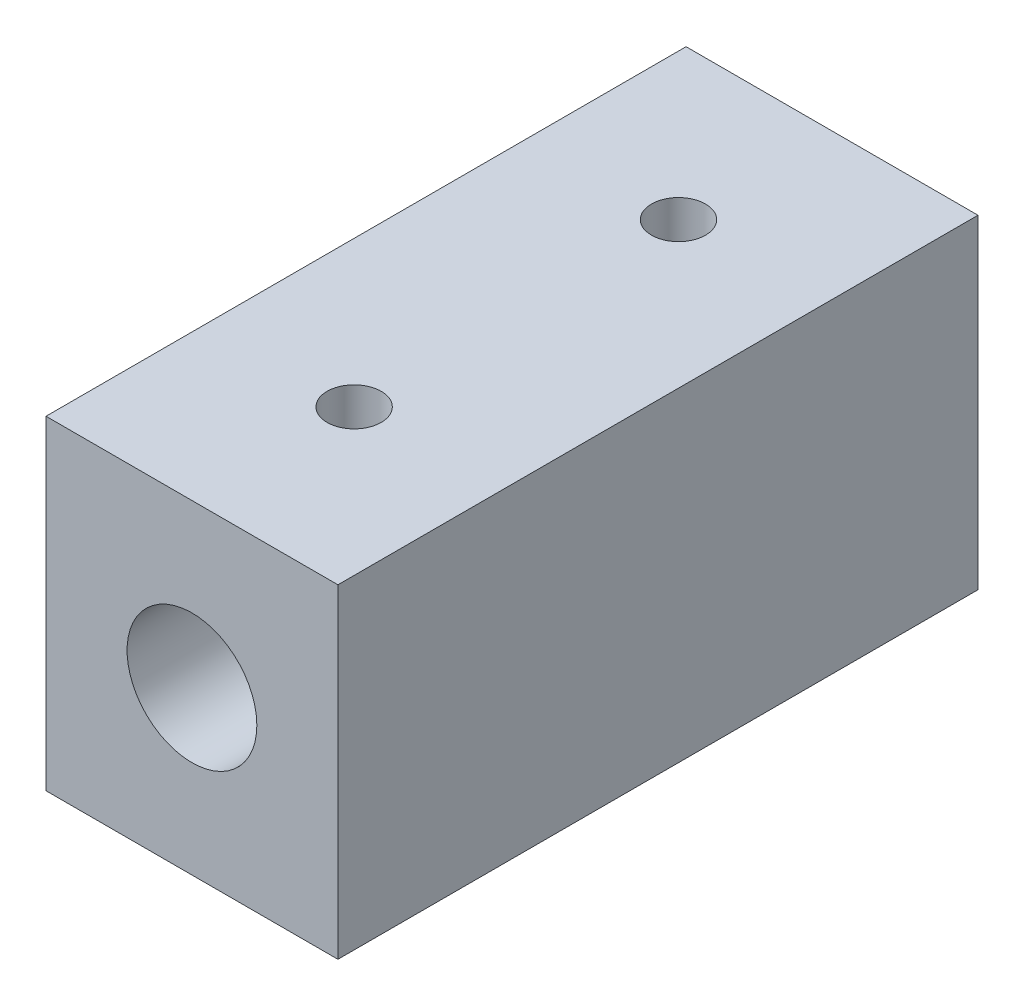
ISO-10303-21;
HEADER;
FILE_DESCRIPTION(('STEP AP214'),'2;1');
FILE_NAME('part.step','',(''),(''),'','','');
FILE_SCHEMA(('AUTOMOTIVE_DESIGN { 1 0 10303 214 1 1 1 1 }'));
ENDSEC;
DATA;
#1=APPLICATION_CONTEXT('core data for automotive mechanical design processes');
#2=APPLICATION_PROTOCOL_DEFINITION('international standard','automotive_design',2000,#1);
#3=PRODUCT_CONTEXT('',#1,'mechanical');
#4=PRODUCT('Part','Part','',(#3));
#5=PRODUCT_RELATED_PRODUCT_CATEGORY('part','',(#4));
#6=PRODUCT_DEFINITION_FORMATION('','',#4);
#7=PRODUCT_DEFINITION_CONTEXT('part definition',#1,'design');
#8=PRODUCT_DEFINITION('design','',#6,#7);
#9=PRODUCT_DEFINITION_SHAPE('','',#8);
#10=(LENGTH_UNIT() NAMED_UNIT(*) SI_UNIT(.MILLI.,.METRE.));
#11=(NAMED_UNIT(*) PLANE_ANGLE_UNIT() SI_UNIT($,.RADIAN.));
#12=(NAMED_UNIT(*) SI_UNIT($,.STERADIAN.) SOLID_ANGLE_UNIT());
#13=UNCERTAINTY_MEASURE_WITH_UNIT(LENGTH_MEASURE(1.E-05),#10,'distance_accuracy_value','');
#14=(GEOMETRIC_REPRESENTATION_CONTEXT(3) GLOBAL_UNCERTAINTY_ASSIGNED_CONTEXT((#13)) GLOBAL_UNIT_ASSIGNED_CONTEXT((#10,
#11,#12)) REPRESENTATION_CONTEXT('',''));
#15=CARTESIAN_POINT('',(0.,0.,0.));
#16=DIRECTION('',(0.,0.,1.));
#17=DIRECTION('',(1.,0.,0.));
#18=AXIS2_PLACEMENT_3D('',#15,#16,#17);
#19=CARTESIAN_POINT('',(-6.75,7.5,14.8));
#20=DIRECTION('',(1.,0.,0.));
#21=DIRECTION('',(0.,1.,0.));
#22=AXIS2_PLACEMENT_3D('',#19,#20,#21);
#23=PLANE('',#22);
#24=DIRECTION('',(0.,-1.,0.));
#25=VECTOR('',#24,1.);
#26=CARTESIAN_POINT('',(-6.75,7.5,-14.8));
#27=LINE('',#26,#25);
#28=CARTESIAN_POINT('',(-6.75,7.5,-14.8));
#29=VERTEX_POINT('',#28);
#30=CARTESIAN_POINT('',(-6.75,-7.5,-14.8));
#31=VERTEX_POINT('',#30);
#32=EDGE_CURVE('E132',#29,#31,#27,.T.);
#33=ORIENTED_EDGE('',*,*,#32,.T.);
#34=DIRECTION('',(0.,0.,-1.));
#35=VECTOR('',#34,1.);
#36=CARTESIAN_POINT('',(-6.75,-7.5,14.8));
#37=LINE('',#36,#35);
#38=CARTESIAN_POINT('',(-6.75,-7.5,14.8));
#39=VERTEX_POINT('',#38);
#40=EDGE_CURVE('E11',#39,#31,#37,.T.);
#41=ORIENTED_EDGE('',*,*,#40,.F.);
#42=DIRECTION('',(0.,-1.,0.));
#43=VECTOR('',#42,1.);
#44=CARTESIAN_POINT('',(-6.75,7.5,14.8));
#45=LINE('',#44,#43);
#46=CARTESIAN_POINT('',(-6.75,7.5,14.8));
#47=VERTEX_POINT('',#46);
#48=EDGE_CURVE('E137',#47,#39,#45,.T.);
#49=ORIENTED_EDGE('',*,*,#48,.F.);
#50=DIRECTION('',(0.,0.,-1.));
#51=VECTOR('',#50,1.);
#52=CARTESIAN_POINT('',(-6.75,7.5,14.8));
#53=LINE('',#52,#51);
#54=EDGE_CURVE('E147',#47,#29,#53,.T.);
#55=ORIENTED_EDGE('',*,*,#54,.T.);
#56=EDGE_LOOP('',(#33,#41,#49,#55));
#57=FACE_BOUND('',#56,.T.);
#58=ADVANCED_FACE('F43',(#57),#23,.F.);
#59=CARTESIAN_POINT('',(-6.75,-7.5,14.8));
#60=DIRECTION('',(0.,1.,0.));
#61=DIRECTION('',(0.,0.,1.));
#62=AXIS2_PLACEMENT_3D('',#59,#60,#61);
#63=PLANE('',#62);
#64=DIRECTION('',(1.,0.,0.));
#65=VECTOR('',#64,1.);
#66=CARTESIAN_POINT('',(-6.75,-7.5,-14.8));
#67=LINE('',#66,#65);
#68=CARTESIAN_POINT('',(6.75,-7.5,-14.8));
#69=VERTEX_POINT('',#68);
#70=EDGE_CURVE('E151',#31,#69,#67,.T.);
#71=ORIENTED_EDGE('',*,*,#70,.T.);
#72=DIRECTION('',(0.,0.,-1.));
#73=VECTOR('',#72,1.);
#74=CARTESIAN_POINT('',(6.75,-7.5,14.8));
#75=LINE('',#74,#73);
#76=CARTESIAN_POINT('',(6.75,-7.5,14.8));
#77=VERTEX_POINT('',#76);
#78=EDGE_CURVE('E53',#77,#69,#75,.T.);
#79=ORIENTED_EDGE('',*,*,#78,.F.);
#80=DIRECTION('',(1.,0.,0.));
#81=VECTOR('',#80,1.);
#82=CARTESIAN_POINT('',(-6.75,-7.5,14.8));
#83=LINE('',#82,#81);
#84=EDGE_CURVE('E92',#39,#77,#83,.T.);
#85=ORIENTED_EDGE('',*,*,#84,.F.);
#86=ORIENTED_EDGE('',*,*,#40,.T.);
#87=EDGE_LOOP('',(#71,#79,#85,#86));
#88=FACE_BOUND('',#87,.T.);
#89=ADVANCED_FACE('F183',(#88),#63,.F.);
#90=CARTESIAN_POINT('',(6.75,7.5,14.8));
#91=DIRECTION('',(-1.,0.,0.));
#92=DIRECTION('',(0.,-1.,0.));
#93=AXIS2_PLACEMENT_3D('',#90,#91,#92);
#94=PLANE('',#93);
#95=DIRECTION('',(0.,1.,0.));
#96=VECTOR('',#95,1.);
#97=CARTESIAN_POINT('',(6.75,7.5,-14.8));
#98=LINE('',#97,#96);
#99=CARTESIAN_POINT('',(6.75,7.5,-14.8));
#100=VERTEX_POINT('',#99);
#101=EDGE_CURVE('E79',#69,#100,#98,.T.);
#102=ORIENTED_EDGE('',*,*,#101,.T.);
#103=DIRECTION('',(0.,0.,-1.));
#104=VECTOR('',#103,1.);
#105=CARTESIAN_POINT('',(6.75,7.5,14.8));
#106=LINE('',#105,#104);
#107=CARTESIAN_POINT('',(6.75,7.5,14.8));
#108=VERTEX_POINT('',#107);
#109=EDGE_CURVE('E160',#108,#100,#106,.T.);
#110=ORIENTED_EDGE('',*,*,#109,.F.);
#111=DIRECTION('',(0.,1.,0.));
#112=VECTOR('',#111,1.);
#113=CARTESIAN_POINT('',(6.75,7.5,14.8));
#114=LINE('',#113,#112);
#115=EDGE_CURVE('E142',#77,#108,#114,.T.);
#116=ORIENTED_EDGE('',*,*,#115,.F.);
#117=ORIENTED_EDGE('',*,*,#78,.T.);
#118=EDGE_LOOP('',(#102,#110,#116,#117));
#119=FACE_BOUND('',#118,.T.);
#120=ADVANCED_FACE('F165',(#119),#94,.F.);
#121=CARTESIAN_POINT('',(-6.75,7.5,14.8));
#122=DIRECTION('',(0.,-1.,0.));
#123=DIRECTION('',(0.,0.,-1.));
#124=AXIS2_PLACEMENT_3D('',#121,#122,#123);
#125=PLANE('',#124);
#126=CARTESIAN_POINT('',(0.,7.5,-7.7));
#127=DIRECTION('',(0.,1.,0.));
#128=DIRECTION('',(0.,0.,1.));
#129=AXIS2_PLACEMENT_3D('',#126,#127,#128);
#130=CIRCLE('',#129,1.24999999999999);
#131=CARTESIAN_POINT('',(0.,7.5,-6.45000000000001));
#132=VERTEX_POINT('',#131);
#133=EDGE_CURVE('E111',#132,#132,#130,.T.);
#134=ORIENTED_EDGE('',*,*,#133,.F.);
#135=EDGE_LOOP('',(#134));
#136=FACE_BOUND('',#135,.T.);
#137=CARTESIAN_POINT('',(0.,7.5,7.3));
#138=DIRECTION('',(0.,1.,0.));
#139=DIRECTION('',(0.,0.,1.));
#140=AXIS2_PLACEMENT_3D('',#137,#138,#139);
#141=CIRCLE('',#140,1.24999999999999);
#142=CARTESIAN_POINT('',(0.,7.5,8.54999999999999));
#143=VERTEX_POINT('',#142);
#144=EDGE_CURVE('E110',#143,#143,#141,.T.);
#145=ORIENTED_EDGE('',*,*,#144,.F.);
#146=EDGE_LOOP('',(#145));
#147=FACE_BOUND('',#146,.T.);
#148=DIRECTION('',(-1.,0.,0.));
#149=VECTOR('',#148,1.);
#150=CARTESIAN_POINT('',(-6.75,7.5,-14.8));
#151=LINE('',#150,#149);
#152=EDGE_CURVE('E85',#100,#29,#151,.T.);
#153=ORIENTED_EDGE('',*,*,#152,.T.);
#154=ORIENTED_EDGE('',*,*,#54,.F.);
#155=DIRECTION('',(-1.,0.,0.));
#156=VECTOR('',#155,1.);
#157=CARTESIAN_POINT('',(-6.75,7.5,14.8));
#158=LINE('',#157,#156);
#159=EDGE_CURVE('E61',#108,#47,#158,.T.);
#160=ORIENTED_EDGE('',*,*,#159,.F.);
#161=ORIENTED_EDGE('',*,*,#109,.T.);
#162=EDGE_LOOP('',(#153,#154,#160,#161));
#163=FACE_BOUND('',#162,.T.);
#164=ADVANCED_FACE('F172',(#136,#147,#163),#125,.F.);
#165=CARTESIAN_POINT('',(0.,0.,14.8));
#166=DIRECTION('',(0.,0.,1.));
#167=DIRECTION('',(1.,0.,0.));
#168=AXIS2_PLACEMENT_3D('',#165,#166,#167);
#169=PLANE('',#168);
#170=CARTESIAN_POINT('',(0.,0.,14.8));
#171=DIRECTION('',(0.,0.,1.));
#172=DIRECTION('',(1.,0.,0.));
#173=AXIS2_PLACEMENT_3D('',#170,#171,#172);
#174=CIRCLE('',#173,3.);
#175=CARTESIAN_POINT('',(3.,0.,14.8));
#176=VERTEX_POINT('',#175);
#177=EDGE_CURVE('E133',#176,#176,#174,.T.);
#178=ORIENTED_EDGE('',*,*,#177,.F.);
#179=EDGE_LOOP('',(#178));
#180=FACE_BOUND('',#179,.T.);
#181=ORIENTED_EDGE('',*,*,#48,.T.);
#182=ORIENTED_EDGE('',*,*,#84,.T.);
#183=ORIENTED_EDGE('',*,*,#115,.T.);
#184=ORIENTED_EDGE('',*,*,#159,.T.);
#185=EDGE_LOOP('',(#181,#182,#183,#184));
#186=FACE_BOUND('',#185,.T.);
#187=ADVANCED_FACE('F174',(#180,#186),#169,.T.);
#188=CARTESIAN_POINT('',(0.,0.,-14.8));
#189=DIRECTION('',(0.,0.,1.));
#190=DIRECTION('',(1.,0.,0.));
#191=AXIS2_PLACEMENT_3D('',#188,#189,#190);
#192=PLANE('',#191);
#193=CARTESIAN_POINT('',(0.,0.,-14.8));
#194=DIRECTION('',(0.,0.,1.));
#195=DIRECTION('',(1.,0.,0.));
#196=AXIS2_PLACEMENT_3D('',#193,#194,#195);
#197=CIRCLE('',#196,1.5);
#198=CARTESIAN_POINT('',(1.5,0.,-14.8));
#199=VERTEX_POINT('',#198);
#200=EDGE_CURVE('E124',#199,#199,#197,.T.);
#201=ORIENTED_EDGE('',*,*,#200,.T.);
#202=EDGE_LOOP('',(#201));
#203=FACE_BOUND('',#202,.T.);
#204=ORIENTED_EDGE('',*,*,#32,.F.);
#205=ORIENTED_EDGE('',*,*,#152,.F.);
#206=ORIENTED_EDGE('',*,*,#101,.F.);
#207=ORIENTED_EDGE('',*,*,#70,.F.);
#208=EDGE_LOOP('',(#204,#205,#206,#207));
#209=FACE_BOUND('',#208,.T.);
#210=ADVANCED_FACE('F168',(#203,#209),#192,.F.);
#211=CARTESIAN_POINT('',(0.,0.,-14.));
#212=DIRECTION('',(0.,0.,1.));
#213=DIRECTION('',(1.,0.,0.));
#214=AXIS2_PLACEMENT_3D('',#211,#212,#213);
#215=CYLINDRICAL_SURFACE('',#214,3.);
#216=CARTESIAN_POINT('',(0.,0.,-14.));
#217=DIRECTION('',(0.,0.,1.));
#218=DIRECTION('',(1.,0.,0.));
#219=AXIS2_PLACEMENT_3D('',#216,#217,#218);
#220=CIRCLE('',#219,3.);
#221=CARTESIAN_POINT('',(3.,0.,-14.));
#222=VERTEX_POINT('',#221);
#223=EDGE_CURVE('E128',#222,#222,#220,.T.);
#224=ORIENTED_EDGE('',*,*,#223,.F.);
#225=EDGE_LOOP('',(#224));
#226=FACE_BOUND('',#225,.T.);
#227=ORIENTED_EDGE('',*,*,#177,.T.);
#228=EDGE_LOOP('',(#227));
#229=FACE_BOUND('',#228,.T.);
#230=ADVANCED_FACE('F212',(#226,#229),#215,.F.);
#231=CARTESIAN_POINT('',(0.,0.,-14.));
#232=DIRECTION('',(0.,0.,1.));
#233=DIRECTION('',(1.,0.,0.));
#234=AXIS2_PLACEMENT_3D('',#231,#232,#233);
#235=PLANE('',#234);
#236=CARTESIAN_POINT('',(0.,0.,-14.));
#237=DIRECTION('',(0.,0.,1.));
#238=DIRECTION('',(1.,0.,0.));
#239=AXIS2_PLACEMENT_3D('',#236,#237,#238);
#240=CIRCLE('',#239,1.5);
#241=CARTESIAN_POINT('',(1.5,0.,-14.));
#242=VERTEX_POINT('',#241);
#243=EDGE_CURVE('E46',#242,#242,#240,.T.);
#244=ORIENTED_EDGE('',*,*,#243,.F.);
#245=EDGE_LOOP('',(#244));
#246=FACE_BOUND('',#245,.T.);
#247=ORIENTED_EDGE('',*,*,#223,.T.);
#248=EDGE_LOOP('',(#247));
#249=FACE_BOUND('',#248,.T.);
#250=ADVANCED_FACE('F217',(#246,#249),#235,.T.);
#251=CARTESIAN_POINT('',(0.,0.,-14.8));
#252=DIRECTION('',(0.,0.,1.));
#253=DIRECTION('',(1.,0.,0.));
#254=AXIS2_PLACEMENT_3D('',#251,#252,#253);
#255=CYLINDRICAL_SURFACE('',#254,1.5);
#256=ORIENTED_EDGE('',*,*,#243,.T.);
#257=EDGE_LOOP('',(#256));
#258=FACE_BOUND('',#257,.T.);
#259=ORIENTED_EDGE('',*,*,#200,.F.);
#260=EDGE_LOOP('',(#259));
#261=FACE_BOUND('',#260,.T.);
#262=ADVANCED_FACE('F233',(#258,#261),#255,.F.);
#263=CARTESIAN_POINT('',(0.,4.8,7.3));
#264=DIRECTION('',(0.,1.,0.));
#265=DIRECTION('',(0.,0.,1.));
#266=AXIS2_PLACEMENT_3D('',#263,#264,#265);
#267=CONICAL_SURFACE('',#266,1.25,1.02974425867665);
#268=CARTESIAN_POINT('',(0.,4.04892422621555,7.3));
#269=VERTEX_POINT('',#268);
#270=VERTEX_LOOP('',#269);
#271=FACE_BOUND('',#270,.T.);
#272=CARTESIAN_POINT('',(0.,4.8,7.3));
#273=DIRECTION('',(0.,1.,0.));
#274=DIRECTION('',(0.,0.,1.));
#275=AXIS2_PLACEMENT_3D('',#272,#273,#274);
#276=CIRCLE('',#275,1.25);
#277=CARTESIAN_POINT('',(0.,4.8,8.55));
#278=VERTEX_POINT('',#277);
#279=EDGE_CURVE('E116',#278,#278,#276,.T.);
#280=ORIENTED_EDGE('',*,*,#279,.T.);
#281=EDGE_LOOP('',(#280));
#282=FACE_BOUND('',#281,.T.);
#283=ADVANCED_FACE('F243',(#271,#282),#267,.F.);
#284=CARTESIAN_POINT('',(0.,7.5,7.3));
#285=DIRECTION('',(0.,1.,0.));
#286=DIRECTION('',(0.,0.,1.));
#287=AXIS2_PLACEMENT_3D('',#284,#285,#286);
#288=CYLINDRICAL_SURFACE('',#287,1.24999999999999);
#289=ORIENTED_EDGE('',*,*,#279,.F.);
#290=EDGE_LOOP('',(#289));
#291=FACE_BOUND('',#290,.T.);
#292=ORIENTED_EDGE('',*,*,#144,.T.);
#293=EDGE_LOOP('',(#292));
#294=FACE_BOUND('',#293,.T.);
#295=ADVANCED_FACE('F103',(#291,#294),#288,.F.);
#296=CARTESIAN_POINT('',(0.,4.8,-7.7));
#297=DIRECTION('',(0.,1.,0.));
#298=DIRECTION('',(0.,0.,1.));
#299=AXIS2_PLACEMENT_3D('',#296,#297,#298);
#300=CONICAL_SURFACE('',#299,1.25,1.02974425867665);
#301=CARTESIAN_POINT('',(0.,4.04892422621555,-7.7));
#302=VERTEX_POINT('',#301);
#303=VERTEX_LOOP('',#302);
#304=FACE_BOUND('',#303,.T.);
#305=CARTESIAN_POINT('',(0.,4.8,-7.7));
#306=DIRECTION('',(0.,1.,0.));
#307=DIRECTION('',(0.,0.,1.));
#308=AXIS2_PLACEMENT_3D('',#305,#306,#307);
#309=CIRCLE('',#308,1.25);
#310=CARTESIAN_POINT('',(0.,4.8,-6.45));
#311=VERTEX_POINT('',#310);
#312=EDGE_CURVE('E107',#311,#311,#309,.T.);
#313=ORIENTED_EDGE('',*,*,#312,.T.);
#314=EDGE_LOOP('',(#313));
#315=FACE_BOUND('',#314,.T.);
#316=ADVANCED_FACE('F99',(#304,#315),#300,.F.);
#317=CARTESIAN_POINT('',(0.,7.5,-7.7));
#318=DIRECTION('',(0.,1.,0.));
#319=DIRECTION('',(0.,0.,1.));
#320=AXIS2_PLACEMENT_3D('',#317,#318,#319);
#321=CYLINDRICAL_SURFACE('',#320,1.24999999999999);
#322=ORIENTED_EDGE('',*,*,#312,.F.);
#323=EDGE_LOOP('',(#322));
#324=FACE_BOUND('',#323,.T.);
#325=ORIENTED_EDGE('',*,*,#133,.T.);
#326=EDGE_LOOP('',(#325));
#327=FACE_BOUND('',#326,.T.);
#328=ADVANCED_FACE('F102',(#324,#327),#321,.F.);
#329=CLOSED_SHELL('',(#58,#89,#120,#164,#187,#210,#230,#250,#262,#283,#295,#316,#328));
#330=MANIFOLD_SOLID_BREP('B2',#329);
#331=ADVANCED_BREP_SHAPE_REPRESENTATION('',(#18,#330),#14);
#332=SHAPE_DEFINITION_REPRESENTATION(#9,#331);
ENDSEC;
END-ISO-10303-21;
